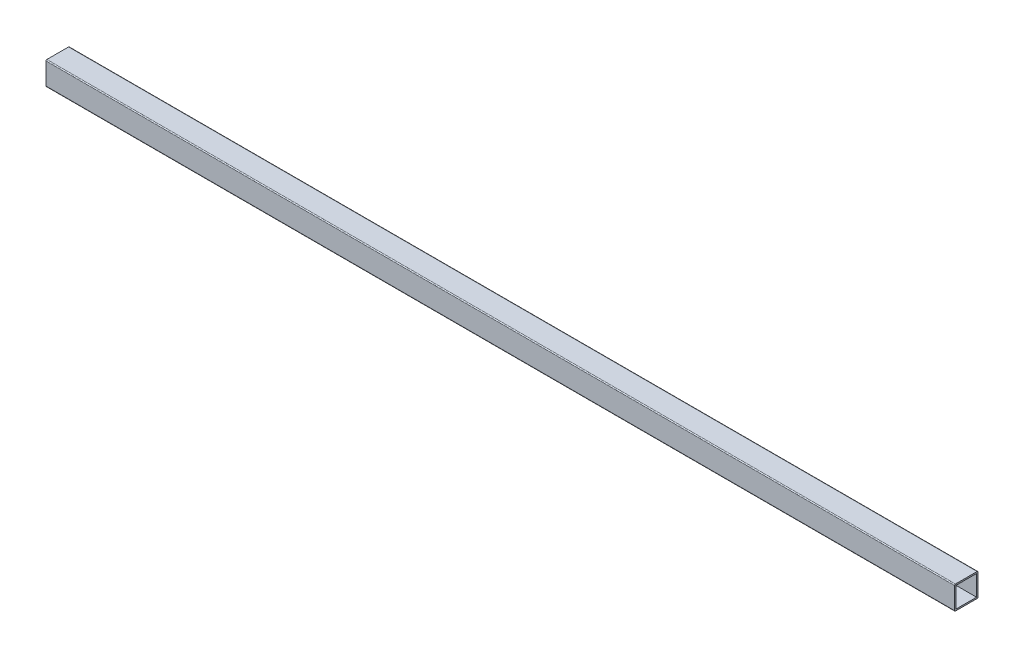
ISO-10303-21;
HEADER;
FILE_DESCRIPTION(('STEP AP214'),'2;1');
FILE_NAME('part.step','',(''),(''),'','','');
FILE_SCHEMA(('AUTOMOTIVE_DESIGN { 1 0 10303 214 1 1 1 1 }'));
ENDSEC;
DATA;
#1=APPLICATION_CONTEXT('core data for automotive mechanical design processes');
#2=APPLICATION_PROTOCOL_DEFINITION('international standard','automotive_design',2000,#1);
#3=PRODUCT_CONTEXT('',#1,'mechanical');
#4=PRODUCT('Part','Part','',(#3));
#5=PRODUCT_RELATED_PRODUCT_CATEGORY('part','',(#4));
#6=PRODUCT_DEFINITION_FORMATION('','',#4);
#7=PRODUCT_DEFINITION_CONTEXT('part definition',#1,'design');
#8=PRODUCT_DEFINITION('design','',#6,#7);
#9=PRODUCT_DEFINITION_SHAPE('','',#8);
#10=(LENGTH_UNIT() NAMED_UNIT(*) SI_UNIT(.MILLI.,.METRE.));
#11=(NAMED_UNIT(*) PLANE_ANGLE_UNIT() SI_UNIT($,.RADIAN.));
#12=(NAMED_UNIT(*) SI_UNIT($,.STERADIAN.) SOLID_ANGLE_UNIT());
#13=UNCERTAINTY_MEASURE_WITH_UNIT(LENGTH_MEASURE(1.E-05),#10,'distance_accuracy_value','');
#14=(GEOMETRIC_REPRESENTATION_CONTEXT(3) GLOBAL_UNCERTAINTY_ASSIGNED_CONTEXT((#13)) GLOBAL_UNIT_ASSIGNED_CONTEXT((#10,
#11,#12)) REPRESENTATION_CONTEXT('',''));
#15=CARTESIAN_POINT('',(0.,0.,0.));
#16=DIRECTION('',(0.,0.,1.));
#17=DIRECTION('',(1.,0.,0.));
#18=AXIS2_PLACEMENT_3D('',#15,#16,#17);
#19=CARTESIAN_POINT('',(-590.,-12.77,-12.77));
#20=DIRECTION('',(0.,0.,-1.));
#21=DIRECTION('',(-1.,0.,0.));
#22=AXIS2_PLACEMENT_3D('',#19,#20,#21);
#23=PLANE('',#22);
#24=DIRECTION('',(0.,1.,0.));
#25=VECTOR('',#24,1.);
#26=CARTESIAN_POINT('',(400.,-12.77,-12.77));
#27=LINE('',#26,#25);
#28=CARTESIAN_POINT('',(400.,-11.77,-12.77));
#29=VERTEX_POINT('',#28);
#30=CARTESIAN_POINT('',(400.,11.77,-12.77));
#31=VERTEX_POINT('',#30);
#32=EDGE_CURVE('E154',#29,#31,#27,.T.);
#33=ORIENTED_EDGE('',*,*,#32,.F.);
#34=DIRECTION('',(1.,0.,0.));
#35=VECTOR('',#34,1.);
#36=CARTESIAN_POINT('',(-590.,-11.77,-12.77));
#37=LINE('',#36,#35);
#38=CARTESIAN_POINT('',(-590.,-11.77,-12.77));
#39=VERTEX_POINT('',#38);
#40=EDGE_CURVE('E217',#29,#39,#37,.F.);
#41=ORIENTED_EDGE('',*,*,#40,.T.);
#42=DIRECTION('',(0.,1.,0.));
#43=VECTOR('',#42,1.);
#44=CARTESIAN_POINT('',(-590.,-12.77,-12.77));
#45=LINE('',#44,#43);
#46=CARTESIAN_POINT('',(-590.,11.77,-12.77));
#47=VERTEX_POINT('',#46);
#48=EDGE_CURVE('E175',#39,#47,#45,.T.);
#49=ORIENTED_EDGE('',*,*,#48,.T.);
#50=DIRECTION('',(1.,0.,0.));
#51=VECTOR('',#50,1.);
#52=CARTESIAN_POINT('',(-590.,11.77,-12.77));
#53=LINE('',#52,#51);
#54=EDGE_CURVE('E214',#47,#31,#53,.T.);
#55=ORIENTED_EDGE('',*,*,#54,.T.);
#56=EDGE_LOOP('',(#33,#41,#49,#55));
#57=FACE_BOUND('',#56,.T.);
#58=ADVANCED_FACE('F33',(#57),#23,.T.);
#59=CARTESIAN_POINT('',(-590.,-12.77,12.77));
#60=DIRECTION('',(0.,-1.,0.));
#61=DIRECTION('',(0.,0.,-1.));
#62=AXIS2_PLACEMENT_3D('',#59,#60,#61);
#63=PLANE('',#62);
#64=DIRECTION('',(0.,0.,-1.));
#65=VECTOR('',#64,1.);
#66=CARTESIAN_POINT('',(400.,-12.77,12.77));
#67=LINE('',#66,#65);
#68=CARTESIAN_POINT('',(400.,-12.77,11.77));
#69=VERTEX_POINT('',#68);
#70=CARTESIAN_POINT('',(400.,-12.77,-11.77));
#71=VERTEX_POINT('',#70);
#72=EDGE_CURVE('E163',#69,#71,#67,.T.);
#73=ORIENTED_EDGE('',*,*,#72,.F.);
#74=DIRECTION('',(1.,0.,0.));
#75=VECTOR('',#74,1.);
#76=CARTESIAN_POINT('',(-590.,-12.77,11.77));
#77=LINE('',#76,#75);
#78=CARTESIAN_POINT('',(-590.,-12.77,11.77));
#79=VERTEX_POINT('',#78);
#80=EDGE_CURVE('E205',#69,#79,#77,.F.);
#81=ORIENTED_EDGE('',*,*,#80,.T.);
#82=DIRECTION('',(0.,0.,-1.));
#83=VECTOR('',#82,1.);
#84=CARTESIAN_POINT('',(-590.,-12.77,12.77));
#85=LINE('',#84,#83);
#86=CARTESIAN_POINT('',(-590.,-12.77,-11.77));
#87=VERTEX_POINT('',#86);
#88=EDGE_CURVE('E186',#79,#87,#85,.T.);
#89=ORIENTED_EDGE('',*,*,#88,.T.);
#90=DIRECTION('',(1.,0.,0.));
#91=VECTOR('',#90,1.);
#92=CARTESIAN_POINT('',(-590.,-12.77,-11.77));
#93=LINE('',#92,#91);
#94=EDGE_CURVE('E202',#87,#71,#93,.T.);
#95=ORIENTED_EDGE('',*,*,#94,.T.);
#96=EDGE_LOOP('',(#73,#81,#89,#95));
#97=FACE_BOUND('',#96,.T.);
#98=ADVANCED_FACE('F232',(#97),#63,.T.);
#99=CARTESIAN_POINT('',(-590.,-12.77,12.77));
#100=DIRECTION('',(0.,0.,1.));
#101=DIRECTION('',(1.,0.,0.));
#102=AXIS2_PLACEMENT_3D('',#99,#100,#101);
#103=PLANE('',#102);
#104=DIRECTION('',(0.,-1.,0.));
#105=VECTOR('',#104,1.);
#106=CARTESIAN_POINT('',(-590.,-12.77,12.77));
#107=LINE('',#106,#105);
#108=CARTESIAN_POINT('',(-590.,11.77,12.77));
#109=VERTEX_POINT('',#108);
#110=CARTESIAN_POINT('',(-590.,-11.77,12.77));
#111=VERTEX_POINT('',#110);
#112=EDGE_CURVE('E183',#109,#111,#107,.T.);
#113=ORIENTED_EDGE('',*,*,#112,.T.);
#114=DIRECTION('',(1.,0.,0.));
#115=VECTOR('',#114,1.);
#116=CARTESIAN_POINT('',(-590.,-11.77,12.77));
#117=LINE('',#116,#115);
#118=CARTESIAN_POINT('',(400.,-11.77,12.77));
#119=VERTEX_POINT('',#118);
#120=EDGE_CURVE('E191',#111,#119,#117,.T.);
#121=ORIENTED_EDGE('',*,*,#120,.T.);
#122=DIRECTION('',(0.,-1.,0.));
#123=VECTOR('',#122,1.);
#124=CARTESIAN_POINT('',(400.,-12.77,12.77));
#125=LINE('',#124,#123);
#126=CARTESIAN_POINT('',(400.,11.77,12.77));
#127=VERTEX_POINT('',#126);
#128=EDGE_CURVE('E160',#127,#119,#125,.T.);
#129=ORIENTED_EDGE('',*,*,#128,.F.);
#130=DIRECTION('',(1.,0.,0.));
#131=VECTOR('',#130,1.);
#132=CARTESIAN_POINT('',(-590.,11.77,12.77));
#133=LINE('',#132,#131);
#134=EDGE_CURVE('E189',#127,#109,#133,.F.);
#135=ORIENTED_EDGE('',*,*,#134,.T.);
#136=EDGE_LOOP('',(#113,#121,#129,#135));
#137=FACE_BOUND('',#136,.T.);
#138=ADVANCED_FACE('F241',(#137),#103,.T.);
#139=CARTESIAN_POINT('',(-590.,12.77,12.77));
#140=DIRECTION('',(0.,1.,0.));
#141=DIRECTION('',(0.,0.,1.));
#142=AXIS2_PLACEMENT_3D('',#139,#140,#141);
#143=PLANE('',#142);
#144=DIRECTION('',(0.,0.,1.));
#145=VECTOR('',#144,1.);
#146=CARTESIAN_POINT('',(-590.,12.77,12.77));
#147=LINE('',#146,#145);
#148=CARTESIAN_POINT('',(-590.,12.77,-11.77));
#149=VERTEX_POINT('',#148);
#150=CARTESIAN_POINT('',(-590.,12.77,11.77));
#151=VERTEX_POINT('',#150);
#152=EDGE_CURVE('E181',#149,#151,#147,.T.);
#153=ORIENTED_EDGE('',*,*,#152,.T.);
#154=DIRECTION('',(1.,0.,0.));
#155=VECTOR('',#154,1.);
#156=CARTESIAN_POINT('',(-590.,12.77,11.77));
#157=LINE('',#156,#155);
#158=CARTESIAN_POINT('',(400.,12.77,11.77));
#159=VERTEX_POINT('',#158);
#160=EDGE_CURVE('E11',#151,#159,#157,.T.);
#161=ORIENTED_EDGE('',*,*,#160,.T.);
#162=DIRECTION('',(0.,0.,1.));
#163=VECTOR('',#162,1.);
#164=CARTESIAN_POINT('',(400.,12.77,12.77));
#165=LINE('',#164,#163);
#166=CARTESIAN_POINT('',(400.,12.77,-11.77));
#167=VERTEX_POINT('',#166);
#168=EDGE_CURVE('E157',#167,#159,#165,.T.);
#169=ORIENTED_EDGE('',*,*,#168,.F.);
#170=DIRECTION('',(1.,0.,0.));
#171=VECTOR('',#170,1.);
#172=CARTESIAN_POINT('',(-590.,12.77,-11.77));
#173=LINE('',#172,#171);
#174=EDGE_CURVE('E41',#167,#149,#173,.F.);
#175=ORIENTED_EDGE('',*,*,#174,.T.);
#176=EDGE_LOOP('',(#153,#161,#169,#175));
#177=FACE_BOUND('',#176,.T.);
#178=ADVANCED_FACE('F246',(#177),#143,.T.);
#179=CARTESIAN_POINT('',(-590.,0.,0.));
#180=DIRECTION('',(-1.,0.,0.));
#181=DIRECTION('',(0.,0.,1.));
#182=AXIS2_PLACEMENT_3D('',#179,#180,#181);
#183=PLANE('',#182);
#184=DIRECTION('',(0.,0.,-1.));
#185=VECTOR('',#184,1.);
#186=CARTESIAN_POINT('',(-590.,-11.1825,11.1825));
#187=LINE('',#186,#185);
#188=CARTESIAN_POINT('',(-590.,-11.1825,11.1825));
#189=VERTEX_POINT('',#188);
#190=CARTESIAN_POINT('',(-590.,-11.1825,-11.1825));
#191=VERTEX_POINT('',#190);
#192=EDGE_CURVE('E166',#189,#191,#187,.T.);
#193=ORIENTED_EDGE('',*,*,#192,.T.);
#194=DIRECTION('',(0.,1.,0.));
#195=VECTOR('',#194,1.);
#196=CARTESIAN_POINT('',(-590.,-11.1825,-11.1825));
#197=LINE('',#196,#195);
#198=CARTESIAN_POINT('',(-590.,11.1825,-11.1825));
#199=VERTEX_POINT('',#198);
#200=EDGE_CURVE('E131',#191,#199,#197,.T.);
#201=ORIENTED_EDGE('',*,*,#200,.T.);
#202=DIRECTION('',(0.,0.,1.));
#203=VECTOR('',#202,1.);
#204=CARTESIAN_POINT('',(-590.,11.1825,11.1825));
#205=LINE('',#204,#203);
#206=CARTESIAN_POINT('',(-590.,11.1825,11.1825));
#207=VERTEX_POINT('',#206);
#208=EDGE_CURVE('E169',#199,#207,#205,.T.);
#209=ORIENTED_EDGE('',*,*,#208,.T.);
#210=DIRECTION('',(0.,-1.,0.));
#211=VECTOR('',#210,1.);
#212=CARTESIAN_POINT('',(-590.,-11.1825,11.1825));
#213=LINE('',#212,#211);
#214=EDGE_CURVE('E136',#207,#189,#213,.T.);
#215=ORIENTED_EDGE('',*,*,#214,.T.);
#216=EDGE_LOOP('',(#193,#201,#209,#215));
#217=FACE_BOUND('',#216,.T.);
#218=ORIENTED_EDGE('',*,*,#88,.F.);
#219=CARTESIAN_POINT('',(-590.,-11.77,11.77));
#220=DIRECTION('',(-1.,0.,0.));
#221=DIRECTION('',(0.,0.,1.));
#222=AXIS2_PLACEMENT_3D('',#219,#220,#221);
#223=CIRCLE('',#222,1.);
#224=EDGE_CURVE('E212',#79,#111,#223,.T.);
#225=ORIENTED_EDGE('',*,*,#224,.T.);
#226=ORIENTED_EDGE('',*,*,#112,.F.);
#227=CARTESIAN_POINT('',(-590.,11.77,11.77));
#228=DIRECTION('',(-1.,0.,0.));
#229=DIRECTION('',(0.,0.,1.));
#230=AXIS2_PLACEMENT_3D('',#227,#228,#229);
#231=CIRCLE('',#230,1.);
#232=EDGE_CURVE('E48',#109,#151,#231,.T.);
#233=ORIENTED_EDGE('',*,*,#232,.T.);
#234=ORIENTED_EDGE('',*,*,#152,.F.);
#235=CARTESIAN_POINT('',(-590.,11.77,-11.77));
#236=DIRECTION('',(-1.,0.,0.));
#237=DIRECTION('',(0.,0.,1.));
#238=AXIS2_PLACEMENT_3D('',#235,#236,#237);
#239=CIRCLE('',#238,1.);
#240=EDGE_CURVE('E207',#149,#47,#239,.T.);
#241=ORIENTED_EDGE('',*,*,#240,.T.);
#242=ORIENTED_EDGE('',*,*,#48,.F.);
#243=CARTESIAN_POINT('',(-590.,-11.77,-11.77));
#244=DIRECTION('',(-1.,0.,0.));
#245=DIRECTION('',(0.,0.,1.));
#246=AXIS2_PLACEMENT_3D('',#243,#244,#245);
#247=CIRCLE('',#246,1.);
#248=EDGE_CURVE('E210',#39,#87,#247,.T.);
#249=ORIENTED_EDGE('',*,*,#248,.T.);
#250=EDGE_LOOP('',(#218,#225,#226,#233,#234,#241,#242,#249));
#251=FACE_BOUND('',#250,.T.);
#252=ADVANCED_FACE('F226',(#217,#251),#183,.T.);
#253=CARTESIAN_POINT('',(-590.,-11.1825,11.1825));
#254=DIRECTION('',(0.,-1.,0.));
#255=DIRECTION('',(0.,0.,-1.));
#256=AXIS2_PLACEMENT_3D('',#253,#254,#255);
#257=PLANE('',#256);
#258=DIRECTION('',(1.,0.,0.));
#259=VECTOR('',#258,1.);
#260=CARTESIAN_POINT('',(-590.,-11.1825,11.1825));
#261=LINE('',#260,#259);
#262=CARTESIAN_POINT('',(400.,-11.1825,11.1825));
#263=VERTEX_POINT('',#262);
#264=EDGE_CURVE('E141',#189,#263,#261,.T.);
#265=ORIENTED_EDGE('',*,*,#264,.T.);
#266=DIRECTION('',(0.,0.,-1.));
#267=VECTOR('',#266,1.);
#268=CARTESIAN_POINT('',(400.,-11.1825,11.1825));
#269=LINE('',#268,#267);
#270=CARTESIAN_POINT('',(400.,-11.1825,-11.1825));
#271=VERTEX_POINT('',#270);
#272=EDGE_CURVE('E139',#263,#271,#269,.T.);
#273=ORIENTED_EDGE('',*,*,#272,.T.);
#274=DIRECTION('',(1.,0.,0.));
#275=VECTOR('',#274,1.);
#276=CARTESIAN_POINT('',(-590.,-11.1825,-11.1825));
#277=LINE('',#276,#275);
#278=EDGE_CURVE('E123',#191,#271,#277,.T.);
#279=ORIENTED_EDGE('',*,*,#278,.F.);
#280=ORIENTED_EDGE('',*,*,#192,.F.);
#281=EDGE_LOOP('',(#265,#273,#279,#280));
#282=FACE_BOUND('',#281,.T.);
#283=ADVANCED_FACE('F140',(#282),#257,.F.);
#284=CARTESIAN_POINT('',(-590.,-11.1825,11.1825));
#285=DIRECTION('',(0.,0.,1.));
#286=DIRECTION('',(1.,0.,0.));
#287=AXIS2_PLACEMENT_3D('',#284,#285,#286);
#288=PLANE('',#287);
#289=DIRECTION('',(1.,0.,0.));
#290=VECTOR('',#289,1.);
#291=CARTESIAN_POINT('',(-590.,11.1825,11.1825));
#292=LINE('',#291,#290);
#293=CARTESIAN_POINT('',(400.,11.1825,11.1825));
#294=VERTEX_POINT('',#293);
#295=EDGE_CURVE('E176',#207,#294,#292,.T.);
#296=ORIENTED_EDGE('',*,*,#295,.T.);
#297=DIRECTION('',(0.,-1.,0.));
#298=VECTOR('',#297,1.);
#299=CARTESIAN_POINT('',(400.,-11.1825,11.1825));
#300=LINE('',#299,#298);
#301=EDGE_CURVE('E150',#294,#263,#300,.T.);
#302=ORIENTED_EDGE('',*,*,#301,.T.);
#303=ORIENTED_EDGE('',*,*,#264,.F.);
#304=ORIENTED_EDGE('',*,*,#214,.F.);
#305=EDGE_LOOP('',(#296,#302,#303,#304));
#306=FACE_BOUND('',#305,.T.);
#307=ADVANCED_FACE('F308',(#306),#288,.F.);
#308=CARTESIAN_POINT('',(-590.,11.1825,11.1825));
#309=DIRECTION('',(0.,1.,0.));
#310=DIRECTION('',(0.,0.,1.));
#311=AXIS2_PLACEMENT_3D('',#308,#309,#310);
#312=PLANE('',#311);
#313=DIRECTION('',(1.,0.,0.));
#314=VECTOR('',#313,1.);
#315=CARTESIAN_POINT('',(-590.,11.1825,-11.1825));
#316=LINE('',#315,#314);
#317=CARTESIAN_POINT('',(400.,11.1825,-11.1825));
#318=VERTEX_POINT('',#317);
#319=EDGE_CURVE('E135',#199,#318,#316,.T.);
#320=ORIENTED_EDGE('',*,*,#319,.T.);
#321=DIRECTION('',(0.,0.,1.));
#322=VECTOR('',#321,1.);
#323=CARTESIAN_POINT('',(400.,11.1825,11.1825));
#324=LINE('',#323,#322);
#325=EDGE_CURVE('E148',#318,#294,#324,.T.);
#326=ORIENTED_EDGE('',*,*,#325,.T.);
#327=ORIENTED_EDGE('',*,*,#295,.F.);
#328=ORIENTED_EDGE('',*,*,#208,.F.);
#329=EDGE_LOOP('',(#320,#326,#327,#328));
#330=FACE_BOUND('',#329,.T.);
#331=ADVANCED_FACE('F300',(#330),#312,.F.);
#332=CARTESIAN_POINT('',(-590.,-11.1825,-11.1825));
#333=DIRECTION('',(0.,0.,-1.));
#334=DIRECTION('',(-1.,0.,0.));
#335=AXIS2_PLACEMENT_3D('',#332,#333,#334);
#336=PLANE('',#335);
#337=ORIENTED_EDGE('',*,*,#278,.T.);
#338=DIRECTION('',(0.,1.,0.));
#339=VECTOR('',#338,1.);
#340=CARTESIAN_POINT('',(400.,-11.1825,-11.1825));
#341=LINE('',#340,#339);
#342=EDGE_CURVE('E128',#271,#318,#341,.T.);
#343=ORIENTED_EDGE('',*,*,#342,.T.);
#344=ORIENTED_EDGE('',*,*,#319,.F.);
#345=ORIENTED_EDGE('',*,*,#200,.F.);
#346=EDGE_LOOP('',(#337,#343,#344,#345));
#347=FACE_BOUND('',#346,.T.);
#348=ADVANCED_FACE('F125',(#347),#336,.F.);
#349=CARTESIAN_POINT('',(400.,0.,0.));
#350=DIRECTION('',(-1.,0.,0.));
#351=DIRECTION('',(0.,0.,1.));
#352=AXIS2_PLACEMENT_3D('',#349,#350,#351);
#353=PLANE('',#352);
#354=ORIENTED_EDGE('',*,*,#128,.T.);
#355=CARTESIAN_POINT('',(400.,-11.77,11.77));
#356=DIRECTION('',(-1.,0.,0.));
#357=DIRECTION('',(0.,0.,1.));
#358=AXIS2_PLACEMENT_3D('',#355,#356,#357);
#359=CIRCLE('',#358,1.);
#360=EDGE_CURVE('E200',#119,#69,#359,.F.);
#361=ORIENTED_EDGE('',*,*,#360,.T.);
#362=ORIENTED_EDGE('',*,*,#72,.T.);
#363=CARTESIAN_POINT('',(400.,-11.77,-11.77));
#364=DIRECTION('',(-1.,0.,0.));
#365=DIRECTION('',(0.,0.,1.));
#366=AXIS2_PLACEMENT_3D('',#363,#364,#365);
#367=CIRCLE('',#366,1.);
#368=EDGE_CURVE('E198',#71,#29,#367,.F.);
#369=ORIENTED_EDGE('',*,*,#368,.T.);
#370=ORIENTED_EDGE('',*,*,#32,.T.);
#371=CARTESIAN_POINT('',(400.,11.77,-11.77));
#372=DIRECTION('',(-1.,0.,0.));
#373=DIRECTION('',(0.,0.,1.));
#374=AXIS2_PLACEMENT_3D('',#371,#372,#373);
#375=CIRCLE('',#374,1.);
#376=EDGE_CURVE('E194',#31,#167,#375,.F.);
#377=ORIENTED_EDGE('',*,*,#376,.T.);
#378=ORIENTED_EDGE('',*,*,#168,.T.);
#379=CARTESIAN_POINT('',(400.,11.77,11.77));
#380=DIRECTION('',(-1.,0.,0.));
#381=DIRECTION('',(0.,0.,1.));
#382=AXIS2_PLACEMENT_3D('',#379,#380,#381);
#383=CIRCLE('',#382,1.);
#384=EDGE_CURVE('E196',#159,#127,#383,.F.);
#385=ORIENTED_EDGE('',*,*,#384,.T.);
#386=EDGE_LOOP('',(#354,#361,#362,#369,#370,#377,#378,#385));
#387=FACE_BOUND('',#386,.T.);
#388=ORIENTED_EDGE('',*,*,#272,.F.);
#389=ORIENTED_EDGE('',*,*,#301,.F.);
#390=ORIENTED_EDGE('',*,*,#325,.F.);
#391=ORIENTED_EDGE('',*,*,#342,.F.);
#392=EDGE_LOOP('',(#388,#389,#390,#391));
#393=FACE_BOUND('',#392,.T.);
#394=ADVANCED_FACE('F146',(#387,#393),#353,.F.);
#395=CARTESIAN_POINT('',(-590.,-11.77,11.77));
#396=DIRECTION('',(1.,0.,0.));
#397=DIRECTION('',(0.,0.,-1.));
#398=AXIS2_PLACEMENT_3D('',#395,#396,#397);
#399=CYLINDRICAL_SURFACE('',#398,1.);
#400=ORIENTED_EDGE('',*,*,#224,.F.);
#401=ORIENTED_EDGE('',*,*,#80,.F.);
#402=ORIENTED_EDGE('',*,*,#360,.F.);
#403=ORIENTED_EDGE('',*,*,#120,.F.);
#404=EDGE_LOOP('',(#400,#401,#402,#403));
#405=FACE_BOUND('',#404,.T.);
#406=ADVANCED_FACE('F239',(#405),#399,.T.);
#407=CARTESIAN_POINT('',(-590.,-11.77,-11.77));
#408=DIRECTION('',(1.,0.,0.));
#409=DIRECTION('',(0.,0.,-1.));
#410=AXIS2_PLACEMENT_3D('',#407,#408,#409);
#411=CYLINDRICAL_SURFACE('',#410,1.);
#412=ORIENTED_EDGE('',*,*,#248,.F.);
#413=ORIENTED_EDGE('',*,*,#40,.F.);
#414=ORIENTED_EDGE('',*,*,#368,.F.);
#415=ORIENTED_EDGE('',*,*,#94,.F.);
#416=EDGE_LOOP('',(#412,#413,#414,#415));
#417=FACE_BOUND('',#416,.T.);
#418=ADVANCED_FACE('F229',(#417),#411,.T.);
#419=CARTESIAN_POINT('',(-590.,11.77,11.77));
#420=DIRECTION('',(1.,0.,0.));
#421=DIRECTION('',(0.,0.,-1.));
#422=AXIS2_PLACEMENT_3D('',#419,#420,#421);
#423=CYLINDRICAL_SURFACE('',#422,1.);
#424=ORIENTED_EDGE('',*,*,#232,.F.);
#425=ORIENTED_EDGE('',*,*,#134,.F.);
#426=ORIENTED_EDGE('',*,*,#384,.F.);
#427=ORIENTED_EDGE('',*,*,#160,.F.);
#428=EDGE_LOOP('',(#424,#425,#426,#427));
#429=FACE_BOUND('',#428,.T.);
#430=ADVANCED_FACE('F245',(#429),#423,.T.);
#431=CARTESIAN_POINT('',(-590.,11.77,-11.77));
#432=DIRECTION('',(1.,0.,0.));
#433=DIRECTION('',(0.,0.,-1.));
#434=AXIS2_PLACEMENT_3D('',#431,#432,#433);
#435=CYLINDRICAL_SURFACE('',#434,1.);
#436=ORIENTED_EDGE('',*,*,#240,.F.);
#437=ORIENTED_EDGE('',*,*,#174,.F.);
#438=ORIENTED_EDGE('',*,*,#376,.F.);
#439=ORIENTED_EDGE('',*,*,#54,.F.);
#440=EDGE_LOOP('',(#436,#437,#438,#439));
#441=FACE_BOUND('',#440,.T.);
#442=ADVANCED_FACE('F35',(#441),#435,.T.);
#443=CLOSED_SHELL('',(#58,#98,#138,#178,#252,#283,#307,#331,#348,#394,#406,#418,#430,#442));
#444=MANIFOLD_SOLID_BREP('B2',#443);
#445=ADVANCED_BREP_SHAPE_REPRESENTATION('',(#18,#444),#14);
#446=SHAPE_DEFINITION_REPRESENTATION(#9,#445);
ENDSEC;
END-ISO-10303-21;
